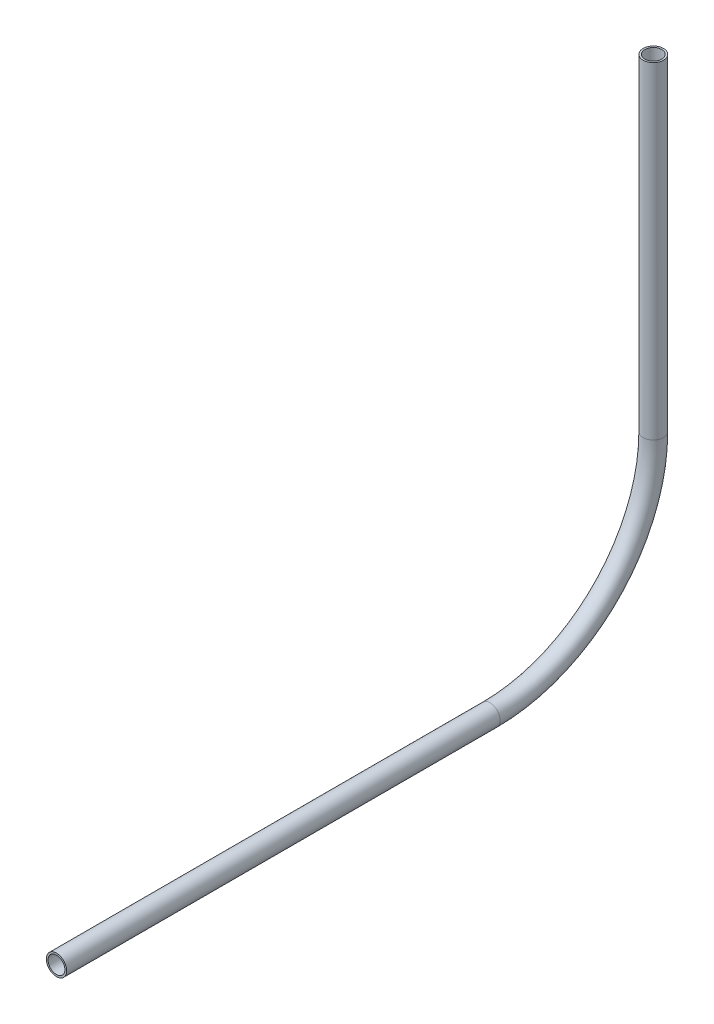
ISO-10303-21;
HEADER;
FILE_DESCRIPTION(('STEP AP214'),'2;1');
FILE_NAME('part.step','',(''),(''),'','','');
FILE_SCHEMA(('AUTOMOTIVE_DESIGN { 1 0 10303 214 1 1 1 1 }'));
ENDSEC;
DATA;
#1=APPLICATION_CONTEXT('core data for automotive mechanical design processes');
#2=APPLICATION_PROTOCOL_DEFINITION('international standard','automotive_design',2000,#1);
#3=PRODUCT_CONTEXT('',#1,'mechanical');
#4=PRODUCT('Part','Part','',(#3));
#5=PRODUCT_RELATED_PRODUCT_CATEGORY('part','',(#4));
#6=PRODUCT_DEFINITION_FORMATION('','',#4);
#7=PRODUCT_DEFINITION_CONTEXT('part definition',#1,'design');
#8=PRODUCT_DEFINITION('design','',#6,#7);
#9=PRODUCT_DEFINITION_SHAPE('','',#8);
#10=(LENGTH_UNIT() NAMED_UNIT(*) SI_UNIT(.MILLI.,.METRE.));
#11=(NAMED_UNIT(*) PLANE_ANGLE_UNIT() SI_UNIT($,.RADIAN.));
#12=(NAMED_UNIT(*) SI_UNIT($,.STERADIAN.) SOLID_ANGLE_UNIT());
#13=UNCERTAINTY_MEASURE_WITH_UNIT(LENGTH_MEASURE(1.E-05),#10,'distance_accuracy_value','');
#14=(GEOMETRIC_REPRESENTATION_CONTEXT(3) GLOBAL_UNCERTAINTY_ASSIGNED_CONTEXT((#13)) GLOBAL_UNIT_ASSIGNED_CONTEXT((#10,
#11,#12)) REPRESENTATION_CONTEXT('',''));
#15=CARTESIAN_POINT('',(0.,0.,0.));
#16=DIRECTION('',(0.,0.,1.));
#17=DIRECTION('',(1.,0.,0.));
#18=AXIS2_PLACEMENT_3D('',#15,#16,#17);
#19=CARTESIAN_POINT('',(0.,599.96001927236,168.273454593785));
#20=DIRECTION('',(0.,0.,1.));
#21=DIRECTION('',(1.,0.,0.));
#22=AXIS2_PLACEMENT_3D('',#19,#20,#21);
#23=CYLINDRICAL_SURFACE('',#22,2.61620000000002);
#24=CARTESIAN_POINT('',(0.,599.96001927236,303.16459571102));
#25=DIRECTION('',(0.,0.,-1.));
#26=DIRECTION('',(-1.,0.,0.));
#27=AXIS2_PLACEMENT_3D('',#24,#25,#26);
#28=CIRCLE('',#27,2.61620000000002);
#29=CARTESIAN_POINT('',(-2.61620000000002,599.96001927236,303.16459571102));
#30=VERTEX_POINT('',#29);
#31=EDGE_CURVE('E55',#30,#30,#28,.T.);
#32=ORIENTED_EDGE('',*,*,#31,.F.);
#33=EDGE_LOOP('',(#32));
#34=FACE_BOUND('',#33,.T.);
#35=CARTESIAN_POINT('',(0.,599.96001927236,168.273454593785));
#36=DIRECTION('',(0.,0.,-1.));
#37=DIRECTION('',(-1.,0.,0.));
#38=AXIS2_PLACEMENT_3D('',#35,#36,#37);
#39=CIRCLE('',#38,2.61620000000002);
#40=CARTESIAN_POINT('',(-2.61620000000002,599.96001927236,168.273454593785));
#41=VERTEX_POINT('',#40);
#42=EDGE_CURVE('E51',#41,#41,#39,.T.);
#43=ORIENTED_EDGE('',*,*,#42,.T.);
#44=EDGE_LOOP('',(#43));
#45=FACE_BOUND('',#44,.T.);
#46=ADVANCED_FACE('F47',(#34,#45),#23,.F.);
#47=CARTESIAN_POINT('',(0.,599.96001927236,168.273454593785));
#48=DIRECTION('',(0.,0.,1.));
#49=DIRECTION('',(1.,0.,0.));
#50=AXIS2_PLACEMENT_3D('',#47,#48,#49);
#51=CYLINDRICAL_SURFACE('',#50,3.17499999999997);
#52=CARTESIAN_POINT('',(0.,599.96001927236,303.16459571102));
#53=DIRECTION('',(0.,0.,-1.));
#54=DIRECTION('',(-1.,0.,0.));
#55=AXIS2_PLACEMENT_3D('',#52,#53,#54);
#56=CIRCLE('',#55,3.17499999999997);
#57=CARTESIAN_POINT('',(-3.17499999999997,599.96001927236,303.16459571102));
#58=VERTEX_POINT('',#57);
#59=EDGE_CURVE('E59',#58,#58,#56,.T.);
#60=ORIENTED_EDGE('',*,*,#59,.T.);
#61=EDGE_LOOP('',(#60));
#62=FACE_BOUND('',#61,.T.);
#63=CARTESIAN_POINT('',(0.,599.96001927236,168.273454593785));
#64=DIRECTION('',(0.,0.,-1.));
#65=DIRECTION('',(-1.,0.,0.));
#66=AXIS2_PLACEMENT_3D('',#63,#64,#65);
#67=CIRCLE('',#66,3.17499999999997);
#68=CARTESIAN_POINT('',(-3.17499999999997,599.96001927236,168.273454593785));
#69=VERTEX_POINT('',#68);
#70=EDGE_CURVE('E12',#69,#69,#67,.T.);
#71=ORIENTED_EDGE('',*,*,#70,.F.);
#72=EDGE_LOOP('',(#71));
#73=FACE_BOUND('',#72,.T.);
#74=ADVANCED_FACE('F74',(#62,#73),#51,.T.);
#75=CARTESIAN_POINT('',(0.,599.96001927236,303.16459571102));
#76=DIRECTION('',(0.,0.,-1.));
#77=DIRECTION('',(-1.,0.,0.));
#78=AXIS2_PLACEMENT_3D('',#75,#76,#77);
#79=PLANE('',#78);
#80=ORIENTED_EDGE('',*,*,#31,.T.);
#81=EDGE_LOOP('',(#80));
#82=FACE_BOUND('',#81,.T.);
#83=ORIENTED_EDGE('',*,*,#59,.F.);
#84=EDGE_LOOP('',(#83));
#85=FACE_BOUND('',#84,.T.);
#86=ADVANCED_FACE('F70',(#82,#85),#79,.F.);
#87=CARTESIAN_POINT('',(0.,599.96001927236,168.273454593785));
#88=DIRECTION('',(0.,0.,-1.));
#89=DIRECTION('',(-1.,0.,0.));
#90=AXIS2_PLACEMENT_3D('',#87,#88,#89);
#91=PLANE('',#90);
#92=ORIENTED_EDGE('',*,*,#42,.F.);
#93=EDGE_LOOP('',(#92));
#94=FACE_BOUND('',#93,.T.);
#95=ORIENTED_EDGE('',*,*,#70,.T.);
#96=EDGE_LOOP('',(#95));
#97=FACE_BOUND('',#96,.T.);
#98=ADVANCED_FACE('F49',(#94,#97),#91,.T.);
#99=CLOSED_SHELL('',(#46,#74,#86,#98));
#100=MANIFOLD_SOLID_BREP('B2',#99);
#101=CARTESIAN_POINT('',(0.,650.76001927236,168.273454593784));
#102=DIRECTION('',(-1.,0.,0.));
#103=DIRECTION('',(0.,0.,1.));
#104=AXIS2_PLACEMENT_3D('',#101,#102,#103);
#105=TOROIDAL_SURFACE('',#104,50.7999999999999,2.61620000000002);
#106=CARTESIAN_POINT('',(0.,650.760019272361,117.473454593784));
#107=DIRECTION('',(0.,1.,0.));
#108=DIRECTION('',(0.,0.,1.));
#109=AXIS2_PLACEMENT_3D('',#106,#107,#108);
#110=CIRCLE('',#109,2.61620000000002);
#111=CARTESIAN_POINT('',(0.,650.760019272361,114.857254593784));
#112=VERTEX_POINT('',#111);
#113=EDGE_CURVE('E150',#112,#112,#110,.T.);
#114=CARTESIAN_POINT('',(0.,599.96001927236,168.273454593784));
#115=DIRECTION('',(0.,0.,1.));
#116=DIRECTION('',(1.,0.,0.));
#117=AXIS2_PLACEMENT_3D('',#114,#115,#116);
#118=CIRCLE('',#117,2.61620000000002);
#119=CARTESIAN_POINT('',(0.,597.34381927236,168.273454593784));
#120=VERTEX_POINT('',#119);
#121=EDGE_CURVE('E140',#120,#120,#118,.T.);
#122=CARTESIAN_POINT('',(0.,650.76001927236,168.273454593784));
#123=DIRECTION('',(-1.,0.,0.));
#124=DIRECTION('',(0.,0.,1.));
#125=AXIS2_PLACEMENT_3D('',#122,#123,#124);
#126=CIRCLE('',#125,53.4161999999999);
#127=EDGE_CURVE('',#112,#120,#126,.T.);
#128=ORIENTED_EDGE('',*,*,#113,.T.);
#129=ORIENTED_EDGE('',*,*,#121,.T.);
#130=ORIENTED_EDGE('',*,*,#127,.T.);
#131=ORIENTED_EDGE('',*,*,#127,.F.);
#132=EDGE_LOOP('',(#128,#130,#129,#131));
#133=FACE_BOUND('',#132,.T.);
#134=ADVANCED_FACE('F136',(#133),#105,.F.);
#135=CARTESIAN_POINT('',(0.,650.76001927236,168.273454593784));
#136=DIRECTION('',(-1.,0.,0.));
#137=DIRECTION('',(0.,0.,1.));
#138=AXIS2_PLACEMENT_3D('',#135,#136,#137);
#139=TOROIDAL_SURFACE('',#138,50.7999999999999,3.17499999999997);
#140=CARTESIAN_POINT('',(0.,650.760019272361,117.473454593784));
#141=DIRECTION('',(0.,1.,0.));
#142=DIRECTION('',(0.,0.,1.));
#143=AXIS2_PLACEMENT_3D('',#140,#141,#142);
#144=CIRCLE('',#143,3.17499999999997);
#145=CARTESIAN_POINT('',(0.,650.760019272361,114.298454593784));
#146=VERTEX_POINT('',#145);
#147=EDGE_CURVE('E144',#146,#146,#144,.T.);
#148=CARTESIAN_POINT('',(0.,599.96001927236,168.273454593784));
#149=DIRECTION('',(0.,0.,1.));
#150=DIRECTION('',(1.,0.,0.));
#151=AXIS2_PLACEMENT_3D('',#148,#149,#150);
#152=CIRCLE('',#151,3.17499999999997);
#153=CARTESIAN_POINT('',(0.,596.78501927236,168.273454593784));
#154=VERTEX_POINT('',#153);
#155=EDGE_CURVE('E46',#154,#154,#152,.T.);
#156=CARTESIAN_POINT('',(0.,650.76001927236,168.273454593784));
#157=DIRECTION('',(-1.,0.,0.));
#158=DIRECTION('',(0.,0.,1.));
#159=AXIS2_PLACEMENT_3D('',#156,#157,#158);
#160=CIRCLE('',#159,53.9749999999999);
#161=EDGE_CURVE('',#146,#154,#160,.T.);
#162=ORIENTED_EDGE('',*,*,#147,.F.);
#163=ORIENTED_EDGE('',*,*,#155,.F.);
#164=ORIENTED_EDGE('',*,*,#161,.T.);
#165=ORIENTED_EDGE('',*,*,#161,.F.);
#166=EDGE_LOOP('',(#162,#164,#163,#165));
#167=FACE_BOUND('',#166,.T.);
#168=ADVANCED_FACE('F163',(#167),#139,.T.);
#169=CARTESIAN_POINT('',(0.,650.76001927236,117.473454593784));
#170=DIRECTION('',(0.,1.,0.));
#171=DIRECTION('',(0.,0.,1.));
#172=AXIS2_PLACEMENT_3D('',#169,#170,#171);
#173=PLANE('',#172);
#174=ORIENTED_EDGE('',*,*,#113,.F.);
#175=EDGE_LOOP('',(#174));
#176=FACE_BOUND('',#175,.T.);
#177=ORIENTED_EDGE('',*,*,#147,.T.);
#178=EDGE_LOOP('',(#177));
#179=FACE_BOUND('',#178,.T.);
#180=ADVANCED_FACE('F159',(#176,#179),#173,.T.);
#181=CARTESIAN_POINT('',(0.,599.96001927236,168.273454593785));
#182=DIRECTION('',(0.,0.,1.));
#183=DIRECTION('',(1.,0.,0.));
#184=AXIS2_PLACEMENT_3D('',#181,#182,#183);
#185=PLANE('',#184);
#186=ORIENTED_EDGE('',*,*,#121,.F.);
#187=EDGE_LOOP('',(#186));
#188=FACE_BOUND('',#187,.T.);
#189=ORIENTED_EDGE('',*,*,#155,.T.);
#190=EDGE_LOOP('',(#189));
#191=FACE_BOUND('',#190,.T.);
#192=ADVANCED_FACE('F138',(#188,#191),#185,.T.);
#193=CLOSED_SHELL('',(#134,#168,#180,#192));
#194=MANIFOLD_SOLID_BREP('B7',#193);
#195=CARTESIAN_POINT('',(0.,752.458618261262,117.473454593784));
#196=DIRECTION('',(0.,-1.,0.));
#197=DIRECTION('',(0.,0.,-1.));
#198=AXIS2_PLACEMENT_3D('',#195,#196,#197);
#199=CYLINDRICAL_SURFACE('',#198,2.61620000000002);
#200=CARTESIAN_POINT('',(0.,752.458618261262,117.473454593784));
#201=DIRECTION('',(0.,1.,0.));
#202=DIRECTION('',(-1.,0.,0.));
#203=AXIS2_PLACEMENT_3D('',#200,#201,#202);
#204=CIRCLE('',#203,2.61620000000002);
#205=CARTESIAN_POINT('',(-2.61620000000002,752.458618261262,117.473454593784));
#206=VERTEX_POINT('',#205);
#207=EDGE_CURVE('E234',#206,#206,#204,.T.);
#208=ORIENTED_EDGE('',*,*,#207,.T.);
#209=EDGE_LOOP('',(#208));
#210=FACE_BOUND('',#209,.T.);
#211=CARTESIAN_POINT('',(0.,650.76001927236,117.473454593784));
#212=DIRECTION('',(0.,-1.,0.));
#213=DIRECTION('',(0.,0.,-1.));
#214=AXIS2_PLACEMENT_3D('',#211,#212,#213);
#215=CIRCLE('',#214,2.61620000000002);
#216=CARTESIAN_POINT('',(0.,650.76001927236,114.857254593784));
#217=VERTEX_POINT('',#216);
#218=EDGE_CURVE('E224',#217,#217,#215,.T.);
#219=ORIENTED_EDGE('',*,*,#218,.T.);
#220=EDGE_LOOP('',(#219));
#221=FACE_BOUND('',#220,.T.);
#222=ADVANCED_FACE('F220',(#210,#221),#199,.F.);
#223=CARTESIAN_POINT('',(0.,752.458618261262,117.473454593784));
#224=DIRECTION('',(0.,-1.,0.));
#225=DIRECTION('',(0.,0.,-1.));
#226=AXIS2_PLACEMENT_3D('',#223,#224,#225);
#227=CYLINDRICAL_SURFACE('',#226,3.17499999999997);
#228=CARTESIAN_POINT('',(0.,752.458618261262,117.473454593784));
#229=DIRECTION('',(0.,1.,0.));
#230=DIRECTION('',(-1.,0.,0.));
#231=AXIS2_PLACEMENT_3D('',#228,#229,#230);
#232=CIRCLE('',#231,3.17499999999997);
#233=CARTESIAN_POINT('',(-3.17499999999997,752.458618261262,117.473454593784));
#234=VERTEX_POINT('',#233);
#235=EDGE_CURVE('E228',#234,#234,#232,.T.);
#236=ORIENTED_EDGE('',*,*,#235,.F.);
#237=EDGE_LOOP('',(#236));
#238=FACE_BOUND('',#237,.T.);
#239=CARTESIAN_POINT('',(0.,650.76001927236,117.473454593784));
#240=DIRECTION('',(0.,-1.,0.));
#241=DIRECTION('',(0.,0.,-1.));
#242=AXIS2_PLACEMENT_3D('',#239,#240,#241);
#243=CIRCLE('',#242,3.17499999999997);
#244=CARTESIAN_POINT('',(0.,650.76001927236,114.298454593784));
#245=VERTEX_POINT('',#244);
#246=EDGE_CURVE('E135',#245,#245,#243,.T.);
#247=ORIENTED_EDGE('',*,*,#246,.F.);
#248=EDGE_LOOP('',(#247));
#249=FACE_BOUND('',#248,.T.);
#250=ADVANCED_FACE('F247',(#238,#249),#227,.T.);
#251=CARTESIAN_POINT('',(0.,752.458618261262,117.473454593784));
#252=DIRECTION('',(0.,1.,0.));
#253=DIRECTION('',(-1.,0.,0.));
#254=AXIS2_PLACEMENT_3D('',#251,#252,#253);
#255=PLANE('',#254);
#256=ORIENTED_EDGE('',*,*,#207,.F.);
#257=EDGE_LOOP('',(#256));
#258=FACE_BOUND('',#257,.T.);
#259=ORIENTED_EDGE('',*,*,#235,.T.);
#260=EDGE_LOOP('',(#259));
#261=FACE_BOUND('',#260,.T.);
#262=ADVANCED_FACE('F243',(#258,#261),#255,.T.);
#263=CARTESIAN_POINT('',(0.,650.76001927236,117.473454593784));
#264=DIRECTION('',(0.,-1.,0.));
#265=DIRECTION('',(0.,0.,-1.));
#266=AXIS2_PLACEMENT_3D('',#263,#264,#265);
#267=PLANE('',#266);
#268=ORIENTED_EDGE('',*,*,#218,.F.);
#269=EDGE_LOOP('',(#268));
#270=FACE_BOUND('',#269,.T.);
#271=ORIENTED_EDGE('',*,*,#246,.T.);
#272=EDGE_LOOP('',(#271));
#273=FACE_BOUND('',#272,.T.);
#274=ADVANCED_FACE('F222',(#270,#273),#267,.T.);
#275=CLOSED_SHELL('',(#222,#250,#262,#274));
#276=MANIFOLD_SOLID_BREP('B41',#275);
#277=ADVANCED_BREP_SHAPE_REPRESENTATION('',(#18,#100,#194,#276),#14);
#278=SHAPE_DEFINITION_REPRESENTATION(#9,#277);
ENDSEC;
END-ISO-10303-21;
